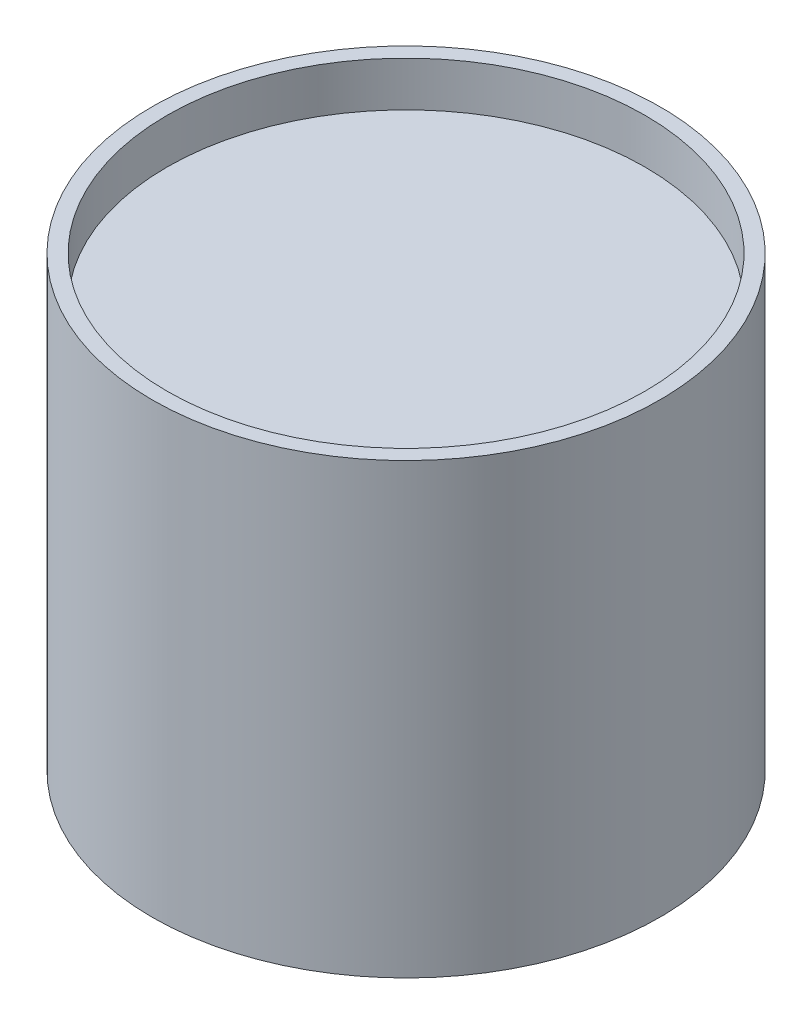
ISO-10303-21;
HEADER;
FILE_DESCRIPTION(('STEP AP214'),'2;1');
FILE_NAME('part.step','',(''),(''),'','','');
FILE_SCHEMA(('AUTOMOTIVE_DESIGN { 1 0 10303 214 1 1 1 1 }'));
ENDSEC;
DATA;
#1=APPLICATION_CONTEXT('core data for automotive mechanical design processes');
#2=APPLICATION_PROTOCOL_DEFINITION('international standard','automotive_design',2000,#1);
#3=PRODUCT_CONTEXT('',#1,'mechanical');
#4=PRODUCT('Part','Part','',(#3));
#5=PRODUCT_RELATED_PRODUCT_CATEGORY('part','',(#4));
#6=PRODUCT_DEFINITION_FORMATION('','',#4);
#7=PRODUCT_DEFINITION_CONTEXT('part definition',#1,'design');
#8=PRODUCT_DEFINITION('design','',#6,#7);
#9=PRODUCT_DEFINITION_SHAPE('','',#8);
#10=(LENGTH_UNIT() NAMED_UNIT(*) SI_UNIT(.MILLI.,.METRE.));
#11=(NAMED_UNIT(*) PLANE_ANGLE_UNIT() SI_UNIT($,.RADIAN.));
#12=(NAMED_UNIT(*) SI_UNIT($,.STERADIAN.) SOLID_ANGLE_UNIT());
#13=UNCERTAINTY_MEASURE_WITH_UNIT(LENGTH_MEASURE(1.E-05),#10,'distance_accuracy_value','');
#14=(GEOMETRIC_REPRESENTATION_CONTEXT(3) GLOBAL_UNCERTAINTY_ASSIGNED_CONTEXT((#13)) GLOBAL_UNIT_ASSIGNED_CONTEXT((#10,
#11,#12)) REPRESENTATION_CONTEXT('',''));
#15=CARTESIAN_POINT('',(0.,0.,0.));
#16=DIRECTION('',(0.,0.,1.));
#17=DIRECTION('',(1.,0.,0.));
#18=AXIS2_PLACEMENT_3D('',#15,#16,#17);
#19=CARTESIAN_POINT('',(0.,30.,0.));
#20=DIRECTION('',(0.,-1.,0.));
#21=DIRECTION('',(0.,0.,-1.));
#22=AXIS2_PLACEMENT_3D('',#19,#20,#21);
#23=CYLINDRICAL_SURFACE('',#22,17.);
#24=CARTESIAN_POINT('',(0.,30.,0.));
#25=DIRECTION('',(0.,1.,0.));
#26=DIRECTION('',(0.,0.,1.));
#27=AXIS2_PLACEMENT_3D('',#24,#25,#26);
#28=CIRCLE('',#27,17.);
#29=CARTESIAN_POINT('',(0.,30.,17.));
#30=VERTEX_POINT('',#29);
#31=EDGE_CURVE('E38',#30,#30,#28,.T.);
#32=ORIENTED_EDGE('',*,*,#31,.F.);
#33=EDGE_LOOP('',(#32));
#34=FACE_BOUND('',#33,.T.);
#35=CARTESIAN_POINT('',(0.,0.,0.));
#36=DIRECTION('',(0.,1.,0.));
#37=DIRECTION('',(0.,0.,1.));
#38=AXIS2_PLACEMENT_3D('',#35,#36,#37);
#39=CIRCLE('',#38,17.);
#40=CARTESIAN_POINT('',(0.,0.,17.));
#41=VERTEX_POINT('',#40);
#42=EDGE_CURVE('E42',#41,#41,#39,.T.);
#43=ORIENTED_EDGE('',*,*,#42,.T.);
#44=EDGE_LOOP('',(#43));
#45=FACE_BOUND('',#44,.T.);
#46=ADVANCED_FACE('F31',(#34,#45),#23,.T.);
#47=CARTESIAN_POINT('',(0.,30.,0.));
#48=DIRECTION('',(0.,1.,0.));
#49=DIRECTION('',(0.,0.,1.));
#50=AXIS2_PLACEMENT_3D('',#47,#48,#49);
#51=PLANE('',#50);
#52=CARTESIAN_POINT('',(0.,30.,0.));
#53=DIRECTION('',(0.,1.,0.));
#54=DIRECTION('',(0.,0.,1.));
#55=AXIS2_PLACEMENT_3D('',#52,#53,#54);
#56=CIRCLE('',#55,16.);
#57=CARTESIAN_POINT('',(0.,30.,16.));
#58=VERTEX_POINT('',#57);
#59=EDGE_CURVE('E49',#58,#58,#56,.T.);
#60=ORIENTED_EDGE('',*,*,#59,.F.);
#61=EDGE_LOOP('',(#60));
#62=FACE_BOUND('',#61,.T.);
#63=ORIENTED_EDGE('',*,*,#31,.T.);
#64=EDGE_LOOP('',(#63));
#65=FACE_BOUND('',#64,.T.);
#66=ADVANCED_FACE('F64',(#62,#65),#51,.T.);
#67=CARTESIAN_POINT('',(0.,0.,0.));
#68=DIRECTION('',(0.,1.,0.));
#69=DIRECTION('',(0.,0.,1.));
#70=AXIS2_PLACEMENT_3D('',#67,#68,#69);
#71=PLANE('',#70);
#72=CARTESIAN_POINT('',(0.,0.,0.));
#73=DIRECTION('',(0.,-1.,0.));
#74=DIRECTION('',(0.,0.,-1.));
#75=AXIS2_PLACEMENT_3D('',#72,#73,#74);
#76=CIRCLE('',#75,1.);
#77=CARTESIAN_POINT('',(0.,0.,-1.));
#78=VERTEX_POINT('',#77);
#79=EDGE_CURVE('E52',#78,#78,#76,.T.);
#80=ORIENTED_EDGE('',*,*,#79,.F.);
#81=EDGE_LOOP('',(#80));
#82=FACE_BOUND('',#81,.T.);
#83=ORIENTED_EDGE('',*,*,#42,.F.);
#84=EDGE_LOOP('',(#83));
#85=FACE_BOUND('',#84,.T.);
#86=ADVANCED_FACE('F60',(#82,#85),#71,.F.);
#87=CARTESIAN_POINT('',(0.,27.,0.));
#88=DIRECTION('',(0.,1.,0.));
#89=DIRECTION('',(0.,0.,1.));
#90=AXIS2_PLACEMENT_3D('',#87,#88,#89);
#91=CYLINDRICAL_SURFACE('',#90,16.);
#92=CARTESIAN_POINT('',(0.,27.,0.));
#93=DIRECTION('',(0.,1.,0.));
#94=DIRECTION('',(0.,0.,1.));
#95=AXIS2_PLACEMENT_3D('',#92,#93,#94);
#96=CIRCLE('',#95,16.);
#97=CARTESIAN_POINT('',(0.,27.,16.));
#98=VERTEX_POINT('',#97);
#99=EDGE_CURVE('E47',#98,#98,#96,.T.);
#100=ORIENTED_EDGE('',*,*,#99,.F.);
#101=EDGE_LOOP('',(#100));
#102=FACE_BOUND('',#101,.T.);
#103=ORIENTED_EDGE('',*,*,#59,.T.);
#104=EDGE_LOOP('',(#103));
#105=FACE_BOUND('',#104,.T.);
#106=ADVANCED_FACE('F63',(#102,#105),#91,.F.);
#107=CARTESIAN_POINT('',(0.,27.,0.));
#108=DIRECTION('',(0.,1.,0.));
#109=DIRECTION('',(0.,0.,1.));
#110=AXIS2_PLACEMENT_3D('',#107,#108,#109);
#111=PLANE('',#110);
#112=ORIENTED_EDGE('',*,*,#99,.T.);
#113=EDGE_LOOP('',(#112));
#114=FACE_BOUND('',#113,.T.);
#115=ADVANCED_FACE('F78',(#114),#111,.T.);
#116=CARTESIAN_POINT('',(0.,2.,0.));
#117=DIRECTION('',(0.,-1.,0.));
#118=DIRECTION('',(0.,0.,-1.));
#119=AXIS2_PLACEMENT_3D('',#116,#117,#118);
#120=CYLINDRICAL_SURFACE('',#119,1.);
#121=CARTESIAN_POINT('',(0.,1.,0.));
#122=DIRECTION('',(0.,-1.,0.));
#123=DIRECTION('',(0.,0.,-1.));
#124=AXIS2_PLACEMENT_3D('',#121,#122,#123);
#125=CIRCLE('',#124,1.);
#126=CARTESIAN_POINT('',(0.,1.,-1.));
#127=VERTEX_POINT('',#126);
#128=EDGE_CURVE('E10',#127,#127,#125,.F.);
#129=ORIENTED_EDGE('',*,*,#128,.T.);
#130=EDGE_LOOP('',(#129));
#131=FACE_BOUND('',#130,.T.);
#132=ORIENTED_EDGE('',*,*,#79,.T.);
#133=EDGE_LOOP('',(#132));
#134=FACE_BOUND('',#133,.T.);
#135=ADVANCED_FACE('F58',(#131,#134),#120,.F.);
#136=CARTESIAN_POINT('',(0.,1.,0.));
#137=DIRECTION('',(0.,-1.,0.));
#138=DIRECTION('',(0.,0.,-1.));
#139=AXIS2_PLACEMENT_3D('',#136,#137,#138);
#140=SPHERICAL_SURFACE('',#139,1.);
#141=ORIENTED_EDGE('',*,*,#128,.F.);
#142=EDGE_LOOP('',(#141));
#143=FACE_BOUND('',#142,.T.);
#144=ADVANCED_FACE('F33',(#143),#140,.F.);
#145=CLOSED_SHELL('',(#46,#66,#86,#106,#115,#135,#144));
#146=MANIFOLD_SOLID_BREP('B2',#145);
#147=ADVANCED_BREP_SHAPE_REPRESENTATION('',(#18,#146),#14);
#148=SHAPE_DEFINITION_REPRESENTATION(#9,#147);
ENDSEC;
END-ISO-10303-21;
